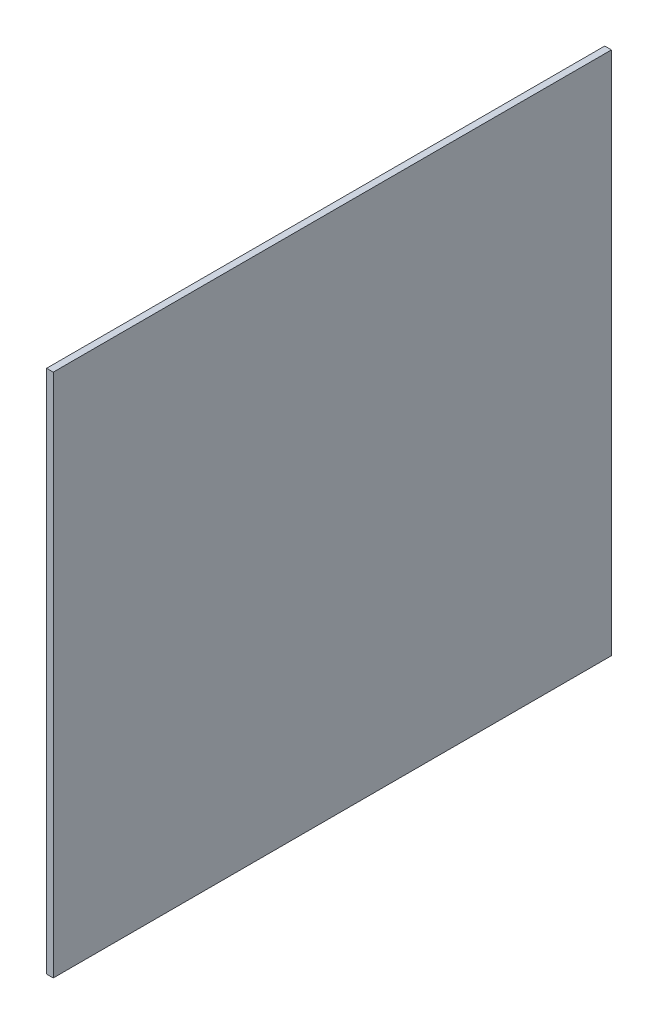
ISO-10303-21;
HEADER;
FILE_DESCRIPTION(('STEP AP214'),'2;1');
FILE_NAME('part.step','',(''),(''),'','','');
FILE_SCHEMA(('AUTOMOTIVE_DESIGN { 1 0 10303 214 1 1 1 1 }'));
ENDSEC;
DATA;
#1=APPLICATION_CONTEXT('core data for automotive mechanical design processes');
#2=APPLICATION_PROTOCOL_DEFINITION('international standard','automotive_design',2000,#1);
#3=PRODUCT_CONTEXT('',#1,'mechanical');
#4=PRODUCT('Part','Part','',(#3));
#5=PRODUCT_RELATED_PRODUCT_CATEGORY('part','',(#4));
#6=PRODUCT_DEFINITION_FORMATION('','',#4);
#7=PRODUCT_DEFINITION_CONTEXT('part definition',#1,'design');
#8=PRODUCT_DEFINITION('design','',#6,#7);
#9=PRODUCT_DEFINITION_SHAPE('','',#8);
#10=(LENGTH_UNIT() NAMED_UNIT(*) SI_UNIT(.MILLI.,.METRE.));
#11=(NAMED_UNIT(*) PLANE_ANGLE_UNIT() SI_UNIT($,.RADIAN.));
#12=(NAMED_UNIT(*) SI_UNIT($,.STERADIAN.) SOLID_ANGLE_UNIT());
#13=UNCERTAINTY_MEASURE_WITH_UNIT(LENGTH_MEASURE(1.E-05),#10,'distance_accuracy_value','');
#14=(GEOMETRIC_REPRESENTATION_CONTEXT(3) GLOBAL_UNCERTAINTY_ASSIGNED_CONTEXT((#13)) GLOBAL_UNIT_ASSIGNED_CONTEXT((#10,
#11,#12)) REPRESENTATION_CONTEXT('',''));
#15=CARTESIAN_POINT('',(0.,0.,0.));
#16=DIRECTION('',(0.,0.,1.));
#17=DIRECTION('',(1.,0.,0.));
#18=AXIS2_PLACEMENT_3D('',#15,#16,#17);
#19=CARTESIAN_POINT('',(60.,2350.,-2500.));
#20=DIRECTION('',(0.,0.,1.));
#21=DIRECTION('',(0.,-1.,0.));
#22=AXIS2_PLACEMENT_3D('',#19,#20,#21);
#23=PLANE('',#22);
#24=DIRECTION('',(0.,1.,0.));
#25=VECTOR('',#24,1.);
#26=CARTESIAN_POINT('',(0.,2350.,-2500.));
#27=LINE('',#26,#25);
#28=CARTESIAN_POINT('',(0.,-2350.,-2500.));
#29=VERTEX_POINT('',#28);
#30=CARTESIAN_POINT('',(0.,2350.,-2500.));
#31=VERTEX_POINT('',#30);
#32=EDGE_CURVE('E97',#29,#31,#27,.T.);
#33=ORIENTED_EDGE('',*,*,#32,.T.);
#34=DIRECTION('',(-1.,0.,0.));
#35=VECTOR('',#34,1.);
#36=CARTESIAN_POINT('',(60.,2350.,-2500.));
#37=LINE('',#36,#35);
#38=CARTESIAN_POINT('',(60.,2350.,-2500.));
#39=VERTEX_POINT('',#38);
#40=EDGE_CURVE('E11',#39,#31,#37,.T.);
#41=ORIENTED_EDGE('',*,*,#40,.F.);
#42=DIRECTION('',(0.,1.,0.));
#43=VECTOR('',#42,1.);
#44=CARTESIAN_POINT('',(60.,2350.,-2500.));
#45=LINE('',#44,#43);
#46=CARTESIAN_POINT('',(60.,-2350.,-2500.));
#47=VERTEX_POINT('',#46);
#48=EDGE_CURVE('E85',#47,#39,#45,.T.);
#49=ORIENTED_EDGE('',*,*,#48,.F.);
#50=DIRECTION('',(-1.,0.,0.));
#51=VECTOR('',#50,1.);
#52=CARTESIAN_POINT('',(60.,-2350.,-2500.));
#53=LINE('',#52,#51);
#54=EDGE_CURVE('E93',#47,#29,#53,.T.);
#55=ORIENTED_EDGE('',*,*,#54,.T.);
#56=EDGE_LOOP('',(#33,#41,#49,#55));
#57=FACE_BOUND('',#56,.T.);
#58=ADVANCED_FACE('F34',(#57),#23,.F.);
#59=CARTESIAN_POINT('',(60.,2350.,2500.));
#60=DIRECTION('',(0.,-1.,0.));
#61=DIRECTION('',(0.,0.,-1.));
#62=AXIS2_PLACEMENT_3D('',#59,#60,#61);
#63=PLANE('',#62);
#64=DIRECTION('',(0.,0.,1.));
#65=VECTOR('',#64,1.);
#66=CARTESIAN_POINT('',(0.,2350.,2500.));
#67=LINE('',#66,#65);
#68=CARTESIAN_POINT('',(0.,2350.,2500.));
#69=VERTEX_POINT('',#68);
#70=EDGE_CURVE('E89',#31,#69,#67,.T.);
#71=ORIENTED_EDGE('',*,*,#70,.T.);
#72=DIRECTION('',(-1.,0.,0.));
#73=VECTOR('',#72,1.);
#74=CARTESIAN_POINT('',(60.,2350.,2500.));
#75=LINE('',#74,#73);
#76=CARTESIAN_POINT('',(60.,2350.,2500.));
#77=VERTEX_POINT('',#76);
#78=EDGE_CURVE('E42',#77,#69,#75,.T.);
#79=ORIENTED_EDGE('',*,*,#78,.F.);
#80=DIRECTION('',(0.,0.,1.));
#81=VECTOR('',#80,1.);
#82=CARTESIAN_POINT('',(60.,2350.,2500.));
#83=LINE('',#82,#81);
#84=EDGE_CURVE('E80',#39,#77,#83,.T.);
#85=ORIENTED_EDGE('',*,*,#84,.F.);
#86=ORIENTED_EDGE('',*,*,#40,.T.);
#87=EDGE_LOOP('',(#71,#79,#85,#86));
#88=FACE_BOUND('',#87,.T.);
#89=ADVANCED_FACE('F88',(#88),#63,.F.);
#90=CARTESIAN_POINT('',(60.,2350.,2500.));
#91=DIRECTION('',(0.,0.,-1.));
#92=DIRECTION('',(0.,1.,0.));
#93=AXIS2_PLACEMENT_3D('',#90,#91,#92);
#94=PLANE('',#93);
#95=DIRECTION('',(0.,-1.,0.));
#96=VECTOR('',#95,1.);
#97=CARTESIAN_POINT('',(0.,2350.,2500.));
#98=LINE('',#97,#96);
#99=CARTESIAN_POINT('',(0.,-2350.,2500.));
#100=VERTEX_POINT('',#99);
#101=EDGE_CURVE('E67',#69,#100,#98,.T.);
#102=ORIENTED_EDGE('',*,*,#101,.T.);
#103=DIRECTION('',(-1.,0.,0.));
#104=VECTOR('',#103,1.);
#105=CARTESIAN_POINT('',(60.,-2350.,2500.));
#106=LINE('',#105,#104);
#107=CARTESIAN_POINT('',(60.,-2350.,2500.));
#108=VERTEX_POINT('',#107);
#109=EDGE_CURVE('E90',#108,#100,#106,.T.);
#110=ORIENTED_EDGE('',*,*,#109,.F.);
#111=DIRECTION('',(0.,-1.,0.));
#112=VECTOR('',#111,1.);
#113=CARTESIAN_POINT('',(60.,2350.,2500.));
#114=LINE('',#113,#112);
#115=EDGE_CURVE('E83',#77,#108,#114,.T.);
#116=ORIENTED_EDGE('',*,*,#115,.F.);
#117=ORIENTED_EDGE('',*,*,#78,.T.);
#118=EDGE_LOOP('',(#102,#110,#116,#117));
#119=FACE_BOUND('',#118,.T.);
#120=ADVANCED_FACE('F91',(#119),#94,.F.);
#121=CARTESIAN_POINT('',(60.,-2350.,2500.));
#122=DIRECTION('',(0.,1.,0.));
#123=DIRECTION('',(0.,0.,1.));
#124=AXIS2_PLACEMENT_3D('',#121,#122,#123);
#125=PLANE('',#124);
#126=DIRECTION('',(0.,0.,-1.));
#127=VECTOR('',#126,1.);
#128=CARTESIAN_POINT('',(0.,-2350.,2500.));
#129=LINE('',#128,#127);
#130=EDGE_CURVE('E73',#100,#29,#129,.T.);
#131=ORIENTED_EDGE('',*,*,#130,.T.);
#132=ORIENTED_EDGE('',*,*,#54,.F.);
#133=DIRECTION('',(0.,0.,-1.));
#134=VECTOR('',#133,1.);
#135=CARTESIAN_POINT('',(60.,-2350.,2500.));
#136=LINE('',#135,#134);
#137=EDGE_CURVE('E50',#108,#47,#136,.T.);
#138=ORIENTED_EDGE('',*,*,#137,.F.);
#139=ORIENTED_EDGE('',*,*,#109,.T.);
#140=EDGE_LOOP('',(#131,#132,#138,#139));
#141=FACE_BOUND('',#140,.T.);
#142=ADVANCED_FACE('F104',(#141),#125,.F.);
#143=CARTESIAN_POINT('',(60.,0.,0.));
#144=DIRECTION('',(1.,0.,0.));
#145=DIRECTION('',(0.,0.,-1.));
#146=AXIS2_PLACEMENT_3D('',#143,#144,#145);
#147=PLANE('',#146);
#148=ORIENTED_EDGE('',*,*,#48,.T.);
#149=ORIENTED_EDGE('',*,*,#84,.T.);
#150=ORIENTED_EDGE('',*,*,#115,.T.);
#151=ORIENTED_EDGE('',*,*,#137,.T.);
#152=EDGE_LOOP('',(#148,#149,#150,#151));
#153=FACE_BOUND('',#152,.T.);
#154=ADVANCED_FACE('F81',(#153),#147,.T.);
#155=CARTESIAN_POINT('',(0.,0.,0.));
#156=DIRECTION('',(1.,0.,0.));
#157=DIRECTION('',(0.,0.,-1.));
#158=AXIS2_PLACEMENT_3D('',#155,#156,#157);
#159=PLANE('',#158);
#160=ORIENTED_EDGE('',*,*,#32,.F.);
#161=ORIENTED_EDGE('',*,*,#130,.F.);
#162=ORIENTED_EDGE('',*,*,#101,.F.);
#163=ORIENTED_EDGE('',*,*,#70,.F.);
#164=EDGE_LOOP('',(#160,#161,#162,#163));
#165=FACE_BOUND('',#164,.T.);
#166=ADVANCED_FACE('F107',(#165),#159,.F.);
#167=CLOSED_SHELL('',(#58,#89,#120,#142,#154,#166));
#168=MANIFOLD_SOLID_BREP('B2',#167);
#169=ADVANCED_BREP_SHAPE_REPRESENTATION('',(#18,#168),#14);
#170=SHAPE_DEFINITION_REPRESENTATION(#9,#169);
ENDSEC;
END-ISO-10303-21;
